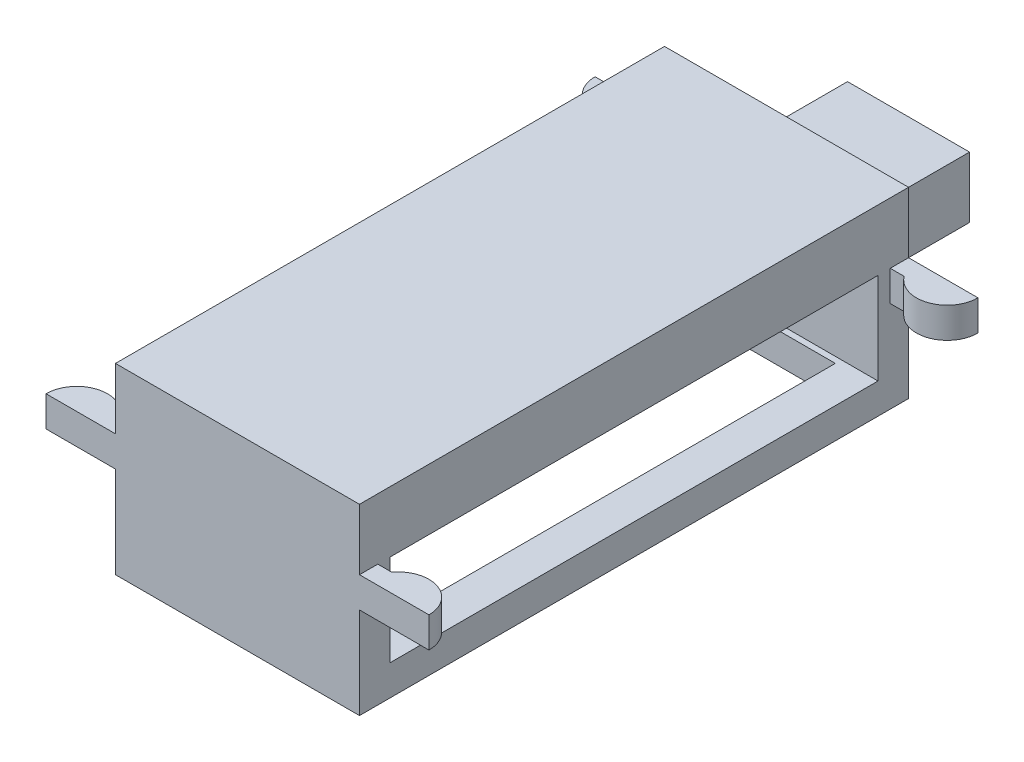
ISO-10303-21;
HEADER;
FILE_DESCRIPTION(('STEP AP214'),'2;1');
FILE_NAME('part.step','',(''),(''),'','','');
FILE_SCHEMA(('AUTOMOTIVE_DESIGN { 1 0 10303 214 1 1 1 1 }'));
ENDSEC;
DATA;
#1=APPLICATION_CONTEXT('core data for automotive mechanical design processes');
#2=APPLICATION_PROTOCOL_DEFINITION('international standard','automotive_design',2000,#1);
#3=PRODUCT_CONTEXT('',#1,'mechanical');
#4=PRODUCT('Part','Part','',(#3));
#5=PRODUCT_RELATED_PRODUCT_CATEGORY('part','',(#4));
#6=PRODUCT_DEFINITION_FORMATION('','',#4);
#7=PRODUCT_DEFINITION_CONTEXT('part definition',#1,'design');
#8=PRODUCT_DEFINITION('design','',#6,#7);
#9=PRODUCT_DEFINITION_SHAPE('','',#8);
#10=(LENGTH_UNIT() NAMED_UNIT(*) SI_UNIT(.MILLI.,.METRE.));
#11=(NAMED_UNIT(*) PLANE_ANGLE_UNIT() SI_UNIT($,.RADIAN.));
#12=(NAMED_UNIT(*) SI_UNIT($,.STERADIAN.) SOLID_ANGLE_UNIT());
#13=UNCERTAINTY_MEASURE_WITH_UNIT(LENGTH_MEASURE(1.E-05),#10,'distance_accuracy_value','');
#14=(GEOMETRIC_REPRESENTATION_CONTEXT(3) GLOBAL_UNCERTAINTY_ASSIGNED_CONTEXT((#13)) GLOBAL_UNIT_ASSIGNED_CONTEXT((#10,
#11,#12)) REPRESENTATION_CONTEXT('',''));
#15=CARTESIAN_POINT('',(0.,0.,0.));
#16=DIRECTION('',(0.,0.,1.));
#17=DIRECTION('',(1.,0.,0.));
#18=AXIS2_PLACEMENT_3D('',#15,#16,#17);
#19=CARTESIAN_POINT('',(0.,0.,-4.5));
#20=DIRECTION('',(0.,0.,-1.));
#21=DIRECTION('',(-1.,0.,0.));
#22=AXIS2_PLACEMENT_3D('',#19,#20,#21);
#23=PLANE('',#22);
#24=DIRECTION('',(0.,-1.,0.));
#25=VECTOR('',#24,1.);
#26=CARTESIAN_POINT('',(2.,1.,-4.5));
#27=LINE('',#26,#25);
#28=CARTESIAN_POINT('',(2.,1.,-4.5));
#29=VERTEX_POINT('',#28);
#30=CARTESIAN_POINT('',(2.,0.,-4.5));
#31=VERTEX_POINT('',#30);
#32=EDGE_CURVE('E441',#29,#31,#27,.T.);
#33=ORIENTED_EDGE('',*,*,#32,.T.);
#34=DIRECTION('',(-1.,0.,0.));
#35=VECTOR('',#34,1.);
#36=CARTESIAN_POINT('',(0.,0.,-4.5));
#37=LINE('',#36,#35);
#38=CARTESIAN_POINT('',(3.13864126573276,0.,-4.50000000000002));
#39=VERTEX_POINT('',#38);
#40=EDGE_CURVE('E336',#39,#31,#37,.T.);
#41=ORIENTED_EDGE('',*,*,#40,.F.);
#42=DIRECTION('',(0.,1.,0.));
#43=VECTOR('',#42,1.);
#44=CARTESIAN_POINT('',(3.13864126573276,-0.5,-4.50000000000002));
#45=LINE('',#44,#43);
#46=CARTESIAN_POINT('',(3.13864126573276,-0.5,-4.50000000000002));
#47=VERTEX_POINT('',#46);
#48=EDGE_CURVE('E347',#47,#39,#45,.T.);
#49=ORIENTED_EDGE('',*,*,#48,.F.);
#50=DIRECTION('',(-1.,0.,0.));
#51=VECTOR('',#50,1.);
#52=CARTESIAN_POINT('',(0.,-0.5,-4.5));
#53=LINE('',#52,#51);
#54=CARTESIAN_POINT('',(2.,-0.5,-4.50000000000001));
#55=VERTEX_POINT('',#54);
#56=EDGE_CURVE('E321',#47,#55,#53,.T.);
#57=ORIENTED_EDGE('',*,*,#56,.T.);
#58=CARTESIAN_POINT('',(2.,-2.,-4.5));
#59=VERTEX_POINT('',#58);
#60=EDGE_CURVE('E445',#55,#59,#27,.T.);
#61=ORIENTED_EDGE('',*,*,#60,.T.);
#62=DIRECTION('',(1.,0.,0.));
#63=VECTOR('',#62,1.);
#64=CARTESIAN_POINT('',(-2.,-2.,-4.5));
#65=LINE('',#64,#63);
#66=CARTESIAN_POINT('',(-2.,-2.,-4.5));
#67=VERTEX_POINT('',#66);
#68=EDGE_CURVE('E404',#67,#59,#65,.T.);
#69=ORIENTED_EDGE('',*,*,#68,.F.);
#70=DIRECTION('',(0.,1.,0.));
#71=VECTOR('',#70,1.);
#72=CARTESIAN_POINT('',(-2.,1.,-4.5));
#73=LINE('',#72,#71);
#74=CARTESIAN_POINT('',(-2.,-0.5,-4.49999999999998));
#75=VERTEX_POINT('',#74);
#76=EDGE_CURVE('E446',#67,#75,#73,.T.);
#77=ORIENTED_EDGE('',*,*,#76,.T.);
#78=CARTESIAN_POINT('',(-3.13864126573276,-0.5,-4.49999999999998));
#79=VERTEX_POINT('',#78);
#80=EDGE_CURVE('E325',#75,#79,#53,.T.);
#81=ORIENTED_EDGE('',*,*,#80,.T.);
#82=DIRECTION('',(0.,1.,0.));
#83=VECTOR('',#82,1.);
#84=CARTESIAN_POINT('',(-3.13864126573276,-0.5,-4.49999999999998));
#85=LINE('',#84,#83);
#86=CARTESIAN_POINT('',(-3.13864126573276,0.,-4.49999999999998));
#87=VERTEX_POINT('',#86);
#88=EDGE_CURVE('E335',#79,#87,#85,.T.);
#89=ORIENTED_EDGE('',*,*,#88,.T.);
#90=CARTESIAN_POINT('',(-2.,0.,-4.49999999999998));
#91=VERTEX_POINT('',#90);
#92=EDGE_CURVE('E320',#91,#87,#37,.T.);
#93=ORIENTED_EDGE('',*,*,#92,.F.);
#94=CARTESIAN_POINT('',(-2.,1.,-4.5));
#95=VERTEX_POINT('',#94);
#96=EDGE_CURVE('E444',#91,#95,#73,.T.);
#97=ORIENTED_EDGE('',*,*,#96,.T.);
#98=DIRECTION('',(1.,0.,0.));
#99=VECTOR('',#98,1.);
#100=CARTESIAN_POINT('',(2.,1.,-4.5));
#101=LINE('',#100,#99);
#102=EDGE_CURVE('E449',#95,#29,#101,.T.);
#103=ORIENTED_EDGE('',*,*,#102,.T.);
#104=EDGE_LOOP('',(#33,#41,#49,#57,#61,#69,#77,#81,#89,#93,#97,#103));
#105=FACE_BOUND('',#104,.T.);
#106=DIRECTION('',(-1.,0.,0.));
#107=VECTOR('',#106,1.);
#108=CARTESIAN_POINT('',(1.,-1.,-4.5));
#109=LINE('',#108,#107);
#110=CARTESIAN_POINT('',(1.,-1.,-4.5));
#111=VERTEX_POINT('',#110);
#112=CARTESIAN_POINT('',(-1.,-1.,-4.5));
#113=VERTEX_POINT('',#112);
#114=EDGE_CURVE('E838',#111,#113,#109,.T.);
#115=ORIENTED_EDGE('',*,*,#114,.F.);
#116=DIRECTION('',(0.,-1.,0.));
#117=VECTOR('',#116,1.);
#118=CARTESIAN_POINT('',(1.,0.,-4.5));
#119=LINE('',#118,#117);
#120=CARTESIAN_POINT('',(1.,0.,-4.5));
#121=VERTEX_POINT('',#120);
#122=EDGE_CURVE('E268',#121,#111,#119,.T.);
#123=ORIENTED_EDGE('',*,*,#122,.F.);
#124=DIRECTION('',(1.,0.,0.));
#125=VECTOR('',#124,1.);
#126=CARTESIAN_POINT('',(1.,0.,-4.5));
#127=LINE('',#126,#125);
#128=CARTESIAN_POINT('',(-1.,0.,-4.5));
#129=VERTEX_POINT('',#128);
#130=EDGE_CURVE('E264',#129,#121,#127,.T.);
#131=ORIENTED_EDGE('',*,*,#130,.F.);
#132=DIRECTION('',(0.,1.,0.));
#133=VECTOR('',#132,1.);
#134=CARTESIAN_POINT('',(-1.,0.,-4.5));
#135=LINE('',#134,#133);
#136=EDGE_CURVE('E835',#113,#129,#135,.T.);
#137=ORIENTED_EDGE('',*,*,#136,.F.);
#138=EDGE_LOOP('',(#115,#123,#131,#137));
#139=FACE_BOUND('',#138,.T.);
#140=ADVANCED_FACE('F37',(#105,#139),#23,.T.);
#141=CARTESIAN_POINT('',(2.,1.,-4.));
#142=DIRECTION('',(-1.,0.,0.));
#143=DIRECTION('',(0.,0.,1.));
#144=AXIS2_PLACEMENT_3D('',#141,#142,#143);
#145=PLANE('',#144);
#146=DIRECTION('',(0.,-1.,0.));
#147=VECTOR('',#146,1.);
#148=CARTESIAN_POINT('',(2.,1.,-4.));
#149=LINE('',#148,#147);
#150=CARTESIAN_POINT('',(2.,0.,-4.));
#151=VERTEX_POINT('',#150);
#152=CARTESIAN_POINT('',(2.,-1.5,-4.));
#153=VERTEX_POINT('',#152);
#154=EDGE_CURVE('E430',#151,#153,#149,.T.);
#155=ORIENTED_EDGE('',*,*,#154,.T.);
#156=DIRECTION('',(0.,0.,1.));
#157=VECTOR('',#156,1.);
#158=CARTESIAN_POINT('',(2.,-1.5,4.5));
#159=LINE('',#158,#157);
#160=CARTESIAN_POINT('',(2.,-1.5,4.));
#161=VERTEX_POINT('',#160);
#162=EDGE_CURVE('E405',#153,#161,#159,.T.);
#163=ORIENTED_EDGE('',*,*,#162,.T.);
#164=DIRECTION('',(0.,-1.,0.));
#165=VECTOR('',#164,1.);
#166=CARTESIAN_POINT('',(2.,1.,4.));
#167=LINE('',#166,#165);
#168=CARTESIAN_POINT('',(2.,0.,4.));
#169=VERTEX_POINT('',#168);
#170=EDGE_CURVE('E414',#169,#161,#167,.T.);
#171=ORIENTED_EDGE('',*,*,#170,.F.);
#172=DIRECTION('',(0.,0.,-1.));
#173=VECTOR('',#172,1.);
#174=CARTESIAN_POINT('',(2.,0.,-4.));
#175=LINE('',#174,#173);
#176=EDGE_CURVE('E452',#169,#151,#175,.T.);
#177=ORIENTED_EDGE('',*,*,#176,.T.);
#178=EDGE_LOOP('',(#155,#163,#171,#177));
#179=FACE_BOUND('',#178,.T.);
#180=DIRECTION('',(0.,0.,-1.));
#181=VECTOR('',#180,1.);
#182=CARTESIAN_POINT('',(2.,-0.5,-4.));
#183=LINE('',#182,#181);
#184=CARTESIAN_POINT('',(2.,-0.5,4.50000000000001));
#185=VERTEX_POINT('',#184);
#186=CARTESIAN_POINT('',(2.,-0.5,4.20000000000001));
#187=VERTEX_POINT('',#186);
#188=EDGE_CURVE('E316',#185,#187,#183,.T.);
#189=ORIENTED_EDGE('',*,*,#188,.F.);
#190=DIRECTION('',(0.,-1.,0.));
#191=VECTOR('',#190,1.);
#192=CARTESIAN_POINT('',(2.,1.,4.5));
#193=LINE('',#192,#191);
#194=CARTESIAN_POINT('',(2.,-2.,4.5));
#195=VERTEX_POINT('',#194);
#196=EDGE_CURVE('E423',#185,#195,#193,.T.);
#197=ORIENTED_EDGE('',*,*,#196,.T.);
#198=DIRECTION('',(0.,0.,1.));
#199=VECTOR('',#198,1.);
#200=CARTESIAN_POINT('',(2.,-2.,4.5));
#201=LINE('',#200,#199);
#202=EDGE_CURVE('E408',#59,#195,#201,.T.);
#203=ORIENTED_EDGE('',*,*,#202,.F.);
#204=ORIENTED_EDGE('',*,*,#60,.F.);
#205=DIRECTION('',(0.,0.,-1.));
#206=VECTOR('',#205,1.);
#207=CARTESIAN_POINT('',(2.,-0.5,-4.));
#208=LINE('',#207,#206);
#209=CARTESIAN_POINT('',(2.,-0.5,-4.20000000000001));
#210=VERTEX_POINT('',#209);
#211=EDGE_CURVE('E364',#210,#55,#208,.T.);
#212=ORIENTED_EDGE('',*,*,#211,.F.);
#213=DIRECTION('',(0.,1.,0.));
#214=VECTOR('',#213,1.);
#215=CARTESIAN_POINT('',(2.,1.,-4.20000000000001));
#216=LINE('',#215,#214);
#217=CARTESIAN_POINT('',(2.,0.,-4.20000000000001));
#218=VERTEX_POINT('',#217);
#219=EDGE_CURVE('E366',#210,#218,#216,.T.);
#220=ORIENTED_EDGE('',*,*,#219,.T.);
#221=DIRECTION('',(0.,0.,-1.));
#222=VECTOR('',#221,1.);
#223=CARTESIAN_POINT('',(2.,0.,-4.));
#224=LINE('',#223,#222);
#225=EDGE_CURVE('E359',#218,#31,#224,.T.);
#226=ORIENTED_EDGE('',*,*,#225,.T.);
#227=ORIENTED_EDGE('',*,*,#32,.F.);
#228=DIRECTION('',(0.,0.,-1.));
#229=VECTOR('',#228,1.);
#230=CARTESIAN_POINT('',(2.,1.,-4.));
#231=LINE('',#230,#229);
#232=CARTESIAN_POINT('',(2.,1.,4.5));
#233=VERTEX_POINT('',#232);
#234=EDGE_CURVE('E464',#233,#29,#231,.T.);
#235=ORIENTED_EDGE('',*,*,#234,.F.);
#236=CARTESIAN_POINT('',(2.,0.,4.50000000000001));
#237=VERTEX_POINT('',#236);
#238=EDGE_CURVE('E419',#233,#237,#193,.T.);
#239=ORIENTED_EDGE('',*,*,#238,.T.);
#240=DIRECTION('',(0.,0.,-1.));
#241=VECTOR('',#240,1.);
#242=CARTESIAN_POINT('',(2.,0.,-4.));
#243=LINE('',#242,#241);
#244=CARTESIAN_POINT('',(2.,0.,4.2));
#245=VERTEX_POINT('',#244);
#246=EDGE_CURVE('E311',#237,#245,#243,.T.);
#247=ORIENTED_EDGE('',*,*,#246,.T.);
#248=DIRECTION('',(0.,1.,0.));
#249=VECTOR('',#248,1.);
#250=CARTESIAN_POINT('',(2.,1.,4.20000000000001));
#251=LINE('',#250,#249);
#252=EDGE_CURVE('E318',#187,#245,#251,.T.);
#253=ORIENTED_EDGE('',*,*,#252,.F.);
#254=EDGE_LOOP('',(#189,#197,#203,#204,#212,#220,#226,#227,#235,#239,#247,#253));
#255=FACE_BOUND('',#254,.T.);
#256=ADVANCED_FACE('F39',(#179,#255),#145,.F.);
#257=CARTESIAN_POINT('',(-2.,1.,-4.));
#258=DIRECTION('',(1.,0.,0.));
#259=DIRECTION('',(0.,0.,-1.));
#260=AXIS2_PLACEMENT_3D('',#257,#258,#259);
#261=PLANE('',#260);
#262=DIRECTION('',(0.,0.,-1.));
#263=VECTOR('',#262,1.);
#264=CARTESIAN_POINT('',(-2.,-1.5,4.5));
#265=LINE('',#264,#263);
#266=CARTESIAN_POINT('',(-2.,-1.5,4.));
#267=VERTEX_POINT('',#266);
#268=CARTESIAN_POINT('',(-2.,-1.5,-4.));
#269=VERTEX_POINT('',#268);
#270=EDGE_CURVE('E400',#267,#269,#265,.T.);
#271=ORIENTED_EDGE('',*,*,#270,.T.);
#272=DIRECTION('',(0.,1.,0.));
#273=VECTOR('',#272,1.);
#274=CARTESIAN_POINT('',(-2.,1.,-4.));
#275=LINE('',#274,#273);
#276=CARTESIAN_POINT('',(-2.,0.,-4.));
#277=VERTEX_POINT('',#276);
#278=EDGE_CURVE('E461',#269,#277,#275,.T.);
#279=ORIENTED_EDGE('',*,*,#278,.T.);
#280=DIRECTION('',(0.,0.,1.));
#281=VECTOR('',#280,1.);
#282=CARTESIAN_POINT('',(-2.,0.,-4.));
#283=LINE('',#282,#281);
#284=CARTESIAN_POINT('',(-2.,0.,4.));
#285=VERTEX_POINT('',#284);
#286=EDGE_CURVE('E479',#277,#285,#283,.T.);
#287=ORIENTED_EDGE('',*,*,#286,.T.);
#288=DIRECTION('',(0.,1.,0.));
#289=VECTOR('',#288,1.);
#290=CARTESIAN_POINT('',(-2.,1.,4.));
#291=LINE('',#290,#289);
#292=EDGE_CURVE('E437',#267,#285,#291,.T.);
#293=ORIENTED_EDGE('',*,*,#292,.F.);
#294=EDGE_LOOP('',(#271,#279,#287,#293));
#295=FACE_BOUND('',#294,.T.);
#296=DIRECTION('',(0.,0.,1.));
#297=VECTOR('',#296,1.);
#298=CARTESIAN_POINT('',(-2.,-0.5,-4.));
#299=LINE('',#298,#297);
#300=CARTESIAN_POINT('',(-2.,-0.5,4.19999999999999));
#301=VERTEX_POINT('',#300);
#302=CARTESIAN_POINT('',(-2.,-0.5,4.49999999999998));
#303=VERTEX_POINT('',#302);
#304=EDGE_CURVE('E314',#301,#303,#299,.T.);
#305=ORIENTED_EDGE('',*,*,#304,.F.);
#306=DIRECTION('',(0.,-1.,0.));
#307=VECTOR('',#306,1.);
#308=CARTESIAN_POINT('',(-2.,1.,4.19999999999999));
#309=LINE('',#308,#307);
#310=CARTESIAN_POINT('',(-2.,0.,4.19999999999999));
#311=VERTEX_POINT('',#310);
#312=EDGE_CURVE('E11',#311,#301,#309,.T.);
#313=ORIENTED_EDGE('',*,*,#312,.F.);
#314=DIRECTION('',(0.,0.,1.));
#315=VECTOR('',#314,1.);
#316=CARTESIAN_POINT('',(-2.,0.,-4.));
#317=LINE('',#316,#315);
#318=CARTESIAN_POINT('',(-2.,0.,4.5));
#319=VERTEX_POINT('',#318);
#320=EDGE_CURVE('E300',#311,#319,#317,.T.);
#321=ORIENTED_EDGE('',*,*,#320,.T.);
#322=DIRECTION('',(0.,1.,0.));
#323=VECTOR('',#322,1.);
#324=CARTESIAN_POINT('',(-2.,1.,4.5));
#325=LINE('',#324,#323);
#326=CARTESIAN_POINT('',(-2.,1.,4.5));
#327=VERTEX_POINT('',#326);
#328=EDGE_CURVE('E426',#319,#327,#325,.T.);
#329=ORIENTED_EDGE('',*,*,#328,.T.);
#330=DIRECTION('',(0.,0.,1.));
#331=VECTOR('',#330,1.);
#332=CARTESIAN_POINT('',(-2.,1.,-4.));
#333=LINE('',#332,#331);
#334=EDGE_CURVE('E466',#95,#327,#333,.T.);
#335=ORIENTED_EDGE('',*,*,#334,.F.);
#336=ORIENTED_EDGE('',*,*,#96,.F.);
#337=DIRECTION('',(0.,0.,1.));
#338=VECTOR('',#337,1.);
#339=CARTESIAN_POINT('',(-2.,0.,-4.));
#340=LINE('',#339,#338);
#341=CARTESIAN_POINT('',(-2.,0.,-4.2));
#342=VERTEX_POINT('',#341);
#343=EDGE_CURVE('E349',#91,#342,#340,.T.);
#344=ORIENTED_EDGE('',*,*,#343,.T.);
#345=DIRECTION('',(0.,-1.,0.));
#346=VECTOR('',#345,1.);
#347=CARTESIAN_POINT('',(-2.,1.,-4.19999999999999));
#348=LINE('',#347,#346);
#349=CARTESIAN_POINT('',(-2.,-0.5,-4.19999999999999));
#350=VERTEX_POINT('',#349);
#351=EDGE_CURVE('E45',#342,#350,#348,.T.);
#352=ORIENTED_EDGE('',*,*,#351,.T.);
#353=DIRECTION('',(0.,0.,1.));
#354=VECTOR('',#353,1.);
#355=CARTESIAN_POINT('',(-2.,-0.5,-4.));
#356=LINE('',#355,#354);
#357=EDGE_CURVE('E362',#75,#350,#356,.T.);
#358=ORIENTED_EDGE('',*,*,#357,.F.);
#359=ORIENTED_EDGE('',*,*,#76,.F.);
#360=DIRECTION('',(0.,0.,-1.));
#361=VECTOR('',#360,1.);
#362=CARTESIAN_POINT('',(-2.,-2.,4.5));
#363=LINE('',#362,#361);
#364=CARTESIAN_POINT('',(-2.,-2.,4.5));
#365=VERTEX_POINT('',#364);
#366=EDGE_CURVE('E401',#365,#67,#363,.T.);
#367=ORIENTED_EDGE('',*,*,#366,.F.);
#368=EDGE_CURVE('E427',#365,#303,#325,.T.);
#369=ORIENTED_EDGE('',*,*,#368,.T.);
#370=EDGE_LOOP('',(#305,#313,#321,#329,#335,#336,#344,#352,#358,#359,#367,#369));
#371=FACE_BOUND('',#370,.T.);
#372=ADVANCED_FACE('F491',(#295,#371),#261,.F.);
#373=CARTESIAN_POINT('',(0.,1.,0.));
#374=DIRECTION('',(0.,1.,0.));
#375=DIRECTION('',(0.,0.,1.));
#376=AXIS2_PLACEMENT_3D('',#373,#374,#375);
#377=PLANE('',#376);
#378=ORIENTED_EDGE('',*,*,#234,.T.);
#379=ORIENTED_EDGE('',*,*,#102,.F.);
#380=ORIENTED_EDGE('',*,*,#334,.T.);
#381=DIRECTION('',(1.,0.,0.));
#382=VECTOR('',#381,1.);
#383=CARTESIAN_POINT('',(2.,1.,4.5));
#384=LINE('',#383,#382);
#385=EDGE_CURVE('E422',#327,#233,#384,.T.);
#386=ORIENTED_EDGE('',*,*,#385,.T.);
#387=EDGE_LOOP('',(#378,#379,#380,#386));
#388=FACE_BOUND('',#387,.T.);
#389=ADVANCED_FACE('F537',(#388),#377,.T.);
#390=CARTESIAN_POINT('',(0.,0.,0.));
#391=DIRECTION('',(0.,1.,0.));
#392=DIRECTION('',(0.,0.,1.));
#393=AXIS2_PLACEMENT_3D('',#390,#391,#392);
#394=PLANE('',#393);
#395=ORIENTED_EDGE('',*,*,#176,.F.);
#396=DIRECTION('',(1.,0.,0.));
#397=VECTOR('',#396,1.);
#398=CARTESIAN_POINT('',(-2.,0.,4.));
#399=LINE('',#398,#397);
#400=EDGE_CURVE('E467',#285,#169,#399,.T.);
#401=ORIENTED_EDGE('',*,*,#400,.F.);
#402=ORIENTED_EDGE('',*,*,#286,.F.);
#403=DIRECTION('',(-1.,0.,0.));
#404=VECTOR('',#403,1.);
#405=CARTESIAN_POINT('',(-2.,0.,-4.));
#406=LINE('',#405,#404);
#407=EDGE_CURVE('E475',#151,#277,#406,.T.);
#408=ORIENTED_EDGE('',*,*,#407,.F.);
#409=EDGE_LOOP('',(#395,#401,#402,#408));
#410=FACE_BOUND('',#409,.T.);
#411=ADVANCED_FACE('F574',(#410),#394,.F.);
#412=CARTESIAN_POINT('',(0.,0.,-4.));
#413=DIRECTION('',(0.,0.,-1.));
#414=DIRECTION('',(-1.,0.,0.));
#415=AXIS2_PLACEMENT_3D('',#412,#413,#414);
#416=PLANE('',#415);
#417=ORIENTED_EDGE('',*,*,#154,.F.);
#418=ORIENTED_EDGE('',*,*,#407,.T.);
#419=ORIENTED_EDGE('',*,*,#278,.F.);
#420=DIRECTION('',(-1.,0.,0.));
#421=VECTOR('',#420,1.);
#422=CARTESIAN_POINT('',(2.,-1.5,-4.));
#423=LINE('',#422,#421);
#424=EDGE_CURVE('E455',#153,#269,#423,.T.);
#425=ORIENTED_EDGE('',*,*,#424,.F.);
#426=EDGE_LOOP('',(#417,#418,#419,#425));
#427=FACE_BOUND('',#426,.T.);
#428=ADVANCED_FACE('F572',(#427),#416,.F.);
#429=CARTESIAN_POINT('',(0.,0.,4.));
#430=DIRECTION('',(0.,0.,1.));
#431=DIRECTION('',(-1.,0.,0.));
#432=AXIS2_PLACEMENT_3D('',#429,#430,#431);
#433=PLANE('',#432);
#434=ORIENTED_EDGE('',*,*,#292,.T.);
#435=ORIENTED_EDGE('',*,*,#400,.T.);
#436=ORIENTED_EDGE('',*,*,#170,.T.);
#437=DIRECTION('',(-1.,0.,0.));
#438=VECTOR('',#437,1.);
#439=CARTESIAN_POINT('',(2.,-1.5,4.));
#440=LINE('',#439,#438);
#441=EDGE_CURVE('E438',#161,#267,#440,.T.);
#442=ORIENTED_EDGE('',*,*,#441,.T.);
#443=EDGE_LOOP('',(#434,#435,#436,#442));
#444=FACE_BOUND('',#443,.T.);
#445=ADVANCED_FACE('F563',(#444),#433,.F.);
#446=CARTESIAN_POINT('',(0.,0.,4.5));
#447=DIRECTION('',(0.,0.,1.));
#448=DIRECTION('',(-1.,0.,0.));
#449=AXIS2_PLACEMENT_3D('',#446,#447,#448);
#450=PLANE('',#449);
#451=ORIENTED_EDGE('',*,*,#328,.F.);
#452=DIRECTION('',(1.,0.,0.));
#453=VECTOR('',#452,1.);
#454=CARTESIAN_POINT('',(0.,0.,4.5));
#455=LINE('',#454,#453);
#456=CARTESIAN_POINT('',(-3.13864126573276,0.,4.49999999999998));
#457=VERTEX_POINT('',#456);
#458=EDGE_CURVE('E272',#457,#319,#455,.T.);
#459=ORIENTED_EDGE('',*,*,#458,.F.);
#460=DIRECTION('',(0.,1.,0.));
#461=VECTOR('',#460,1.);
#462=CARTESIAN_POINT('',(-3.13864126573276,-0.5,4.49999999999998));
#463=LINE('',#462,#461);
#464=CARTESIAN_POINT('',(-3.13864126573276,-0.5,4.49999999999998));
#465=VERTEX_POINT('',#464);
#466=EDGE_CURVE('E298',#465,#457,#463,.T.);
#467=ORIENTED_EDGE('',*,*,#466,.F.);
#468=DIRECTION('',(1.,0.,0.));
#469=VECTOR('',#468,1.);
#470=CARTESIAN_POINT('',(0.,-0.5,4.5));
#471=LINE('',#470,#469);
#472=EDGE_CURVE('E277',#465,#303,#471,.T.);
#473=ORIENTED_EDGE('',*,*,#472,.T.);
#474=ORIENTED_EDGE('',*,*,#368,.F.);
#475=DIRECTION('',(-1.,0.,0.));
#476=VECTOR('',#475,1.);
#477=CARTESIAN_POINT('',(-2.,-2.,4.5));
#478=LINE('',#477,#476);
#479=EDGE_CURVE('E411',#195,#365,#478,.T.);
#480=ORIENTED_EDGE('',*,*,#479,.F.);
#481=ORIENTED_EDGE('',*,*,#196,.F.);
#482=CARTESIAN_POINT('',(3.13864126573276,-0.5,4.50000000000002));
#483=VERTEX_POINT('',#482);
#484=EDGE_CURVE('E281',#185,#483,#471,.T.);
#485=ORIENTED_EDGE('',*,*,#484,.T.);
#486=DIRECTION('',(0.,1.,0.));
#487=VECTOR('',#486,1.);
#488=CARTESIAN_POINT('',(3.13864126573276,-0.5,4.50000000000002));
#489=LINE('',#488,#487);
#490=CARTESIAN_POINT('',(3.13864126573276,0.,4.50000000000002));
#491=VERTEX_POINT('',#490);
#492=EDGE_CURVE('E289',#483,#491,#489,.T.);
#493=ORIENTED_EDGE('',*,*,#492,.T.);
#494=EDGE_CURVE('E270',#237,#491,#455,.T.);
#495=ORIENTED_EDGE('',*,*,#494,.F.);
#496=ORIENTED_EDGE('',*,*,#238,.F.);
#497=ORIENTED_EDGE('',*,*,#385,.F.);
#498=EDGE_LOOP('',(#451,#459,#467,#473,#474,#480,#481,#485,#493,#495,#496,#497));
#499=FACE_BOUND('',#498,.T.);
#500=ADVANCED_FACE('F517',(#499),#450,.T.);
#501=CARTESIAN_POINT('',(0.,-1.5,0.));
#502=DIRECTION('',(0.,-1.,0.));
#503=DIRECTION('',(0.,0.,-1.));
#504=AXIS2_PLACEMENT_3D('',#501,#502,#503);
#505=PLANE('',#504);
#506=DIRECTION('',(0.,0.,-1.));
#507=VECTOR('',#506,1.);
#508=CARTESIAN_POINT('',(-1.4,-1.5,3.9));
#509=LINE('',#508,#507);
#510=CARTESIAN_POINT('',(-1.4,-1.5,3.9));
#511=VERTEX_POINT('',#510);
#512=CARTESIAN_POINT('',(-1.4,-1.5,-3.9));
#513=VERTEX_POINT('',#512);
#514=EDGE_CURVE('E369',#511,#513,#509,.T.);
#515=ORIENTED_EDGE('',*,*,#514,.T.);
#516=DIRECTION('',(1.,0.,0.));
#517=VECTOR('',#516,1.);
#518=CARTESIAN_POINT('',(-1.4,-1.5,-3.9));
#519=LINE('',#518,#517);
#520=CARTESIAN_POINT('',(1.4,-1.5,-3.9));
#521=VERTEX_POINT('',#520);
#522=EDGE_CURVE('E383',#513,#521,#519,.T.);
#523=ORIENTED_EDGE('',*,*,#522,.T.);
#524=DIRECTION('',(0.,0.,1.));
#525=VECTOR('',#524,1.);
#526=CARTESIAN_POINT('',(1.4,-1.5,3.9));
#527=LINE('',#526,#525);
#528=CARTESIAN_POINT('',(1.4,-1.5,3.9));
#529=VERTEX_POINT('',#528);
#530=EDGE_CURVE('E386',#521,#529,#527,.T.);
#531=ORIENTED_EDGE('',*,*,#530,.T.);
#532=DIRECTION('',(-1.,0.,0.));
#533=VECTOR('',#532,1.);
#534=CARTESIAN_POINT('',(-1.4,-1.5,3.9));
#535=LINE('',#534,#533);
#536=EDGE_CURVE('E373',#529,#511,#535,.T.);
#537=ORIENTED_EDGE('',*,*,#536,.T.);
#538=EDGE_LOOP('',(#515,#523,#531,#537));
#539=FACE_BOUND('',#538,.T.);
#540=ORIENTED_EDGE('',*,*,#162,.F.);
#541=ORIENTED_EDGE('',*,*,#424,.T.);
#542=ORIENTED_EDGE('',*,*,#270,.F.);
#543=ORIENTED_EDGE('',*,*,#441,.F.);
#544=EDGE_LOOP('',(#540,#541,#542,#543));
#545=FACE_BOUND('',#544,.T.);
#546=ADVANCED_FACE('F566',(#539,#545),#505,.F.);
#547=CARTESIAN_POINT('',(0.,-2.,0.));
#548=DIRECTION('',(0.,-1.,0.));
#549=DIRECTION('',(0.,0.,-1.));
#550=AXIS2_PLACEMENT_3D('',#547,#548,#549);
#551=PLANE('',#550);
#552=ORIENTED_EDGE('',*,*,#366,.T.);
#553=ORIENTED_EDGE('',*,*,#68,.T.);
#554=ORIENTED_EDGE('',*,*,#202,.T.);
#555=ORIENTED_EDGE('',*,*,#479,.T.);
#556=EDGE_LOOP('',(#552,#553,#554,#555));
#557=FACE_BOUND('',#556,.T.);
#558=DIRECTION('',(1.,0.,0.));
#559=VECTOR('',#558,1.);
#560=CARTESIAN_POINT('',(-1.4,-2.,-3.9));
#561=LINE('',#560,#559);
#562=CARTESIAN_POINT('',(-1.4,-2.,-3.9));
#563=VERTEX_POINT('',#562);
#564=CARTESIAN_POINT('',(1.4,-2.,-3.9));
#565=VERTEX_POINT('',#564);
#566=EDGE_CURVE('E372',#563,#565,#561,.T.);
#567=ORIENTED_EDGE('',*,*,#566,.F.);
#568=DIRECTION('',(0.,0.,-1.));
#569=VECTOR('',#568,1.);
#570=CARTESIAN_POINT('',(-1.4,-2.,3.9));
#571=LINE('',#570,#569);
#572=CARTESIAN_POINT('',(-1.4,-2.,3.9));
#573=VERTEX_POINT('',#572);
#574=EDGE_CURVE('E370',#573,#563,#571,.T.);
#575=ORIENTED_EDGE('',*,*,#574,.F.);
#576=DIRECTION('',(-1.,0.,0.));
#577=VECTOR('',#576,1.);
#578=CARTESIAN_POINT('',(-1.4,-2.,3.9));
#579=LINE('',#578,#577);
#580=CARTESIAN_POINT('',(1.4,-2.,3.9));
#581=VERTEX_POINT('',#580);
#582=EDGE_CURVE('E378',#581,#573,#579,.T.);
#583=ORIENTED_EDGE('',*,*,#582,.F.);
#584=DIRECTION('',(0.,0.,1.));
#585=VECTOR('',#584,1.);
#586=CARTESIAN_POINT('',(1.4,-2.,3.9));
#587=LINE('',#586,#585);
#588=EDGE_CURVE('E375',#565,#581,#587,.T.);
#589=ORIENTED_EDGE('',*,*,#588,.F.);
#590=EDGE_LOOP('',(#567,#575,#583,#589));
#591=FACE_BOUND('',#590,.T.);
#592=ADVANCED_FACE('F510',(#557,#591),#551,.T.);
#593=CARTESIAN_POINT('',(-1.4,-2.,3.9));
#594=DIRECTION('',(1.,0.,0.));
#595=DIRECTION('',(0.,0.,-1.));
#596=AXIS2_PLACEMENT_3D('',#593,#594,#595);
#597=PLANE('',#596);
#598=ORIENTED_EDGE('',*,*,#514,.F.);
#599=DIRECTION('',(0.,1.,0.));
#600=VECTOR('',#599,1.);
#601=CARTESIAN_POINT('',(-1.4,-2.,3.9));
#602=LINE('',#601,#600);
#603=EDGE_CURVE('E380',#573,#511,#602,.T.);
#604=ORIENTED_EDGE('',*,*,#603,.F.);
#605=ORIENTED_EDGE('',*,*,#574,.T.);
#606=DIRECTION('',(0.,1.,0.));
#607=VECTOR('',#606,1.);
#608=CARTESIAN_POINT('',(-1.4,-2.,-3.9));
#609=LINE('',#608,#607);
#610=EDGE_CURVE('E397',#563,#513,#609,.T.);
#611=ORIENTED_EDGE('',*,*,#610,.T.);
#612=EDGE_LOOP('',(#598,#604,#605,#611));
#613=FACE_BOUND('',#612,.T.);
#614=ADVANCED_FACE('F622',(#613),#597,.T.);
#615=CARTESIAN_POINT('',(-1.4,-2.,-3.9));
#616=DIRECTION('',(0.,0.,1.));
#617=DIRECTION('',(1.,0.,0.));
#618=AXIS2_PLACEMENT_3D('',#615,#616,#617);
#619=PLANE('',#618);
#620=ORIENTED_EDGE('',*,*,#522,.F.);
#621=ORIENTED_EDGE('',*,*,#610,.F.);
#622=ORIENTED_EDGE('',*,*,#566,.T.);
#623=DIRECTION('',(0.,1.,0.));
#624=VECTOR('',#623,1.);
#625=CARTESIAN_POINT('',(1.4,-2.,-3.9));
#626=LINE('',#625,#624);
#627=EDGE_CURVE('E395',#565,#521,#626,.T.);
#628=ORIENTED_EDGE('',*,*,#627,.T.);
#629=EDGE_LOOP('',(#620,#621,#622,#628));
#630=FACE_BOUND('',#629,.T.);
#631=ADVANCED_FACE('F629',(#630),#619,.T.);
#632=CARTESIAN_POINT('',(1.4,-2.,3.9));
#633=DIRECTION('',(-1.,0.,0.));
#634=DIRECTION('',(0.,0.,1.));
#635=AXIS2_PLACEMENT_3D('',#632,#633,#634);
#636=PLANE('',#635);
#637=ORIENTED_EDGE('',*,*,#530,.F.);
#638=ORIENTED_EDGE('',*,*,#627,.F.);
#639=ORIENTED_EDGE('',*,*,#588,.T.);
#640=DIRECTION('',(0.,1.,0.));
#641=VECTOR('',#640,1.);
#642=CARTESIAN_POINT('',(1.4,-2.,3.9));
#643=LINE('',#642,#641);
#644=EDGE_CURVE('E393',#581,#529,#643,.T.);
#645=ORIENTED_EDGE('',*,*,#644,.T.);
#646=EDGE_LOOP('',(#637,#638,#639,#645));
#647=FACE_BOUND('',#646,.T.);
#648=ADVANCED_FACE('F637',(#647),#636,.T.);
#649=CARTESIAN_POINT('',(-1.4,-2.,3.9));
#650=DIRECTION('',(0.,0.,-1.));
#651=DIRECTION('',(-1.,0.,0.));
#652=AXIS2_PLACEMENT_3D('',#649,#650,#651);
#653=PLANE('',#652);
#654=ORIENTED_EDGE('',*,*,#536,.F.);
#655=ORIENTED_EDGE('',*,*,#644,.F.);
#656=ORIENTED_EDGE('',*,*,#582,.T.);
#657=ORIENTED_EDGE('',*,*,#603,.T.);
#658=EDGE_LOOP('',(#654,#655,#656,#657));
#659=FACE_BOUND('',#658,.T.);
#660=ADVANCED_FACE('F645',(#659),#653,.T.);
#661=CARTESIAN_POINT('',(-2.63386895184272,-0.5,-4.49999999999998));
#662=DIRECTION('',(0.,1.,0.));
#663=DIRECTION('',(0.,0.,1.));
#664=AXIS2_PLACEMENT_3D('',#661,#662,#663);
#665=CYLINDRICAL_SURFACE('',#664,0.504772313890046);
#666=CARTESIAN_POINT('',(-2.63386895184272,0.,-4.49999999999998));
#667=DIRECTION('',(0.,1.,0.));
#668=DIRECTION('',(0.,0.,1.));
#669=AXIS2_PLACEMENT_3D('',#666,#667,#668);
#670=CIRCLE('',#669,0.504772313890046);
#671=CARTESIAN_POINT('',(-2.22791933813442,0.,-4.19999999999998));
#672=VERTEX_POINT('',#671);
#673=EDGE_CURVE('E338',#87,#672,#670,.T.);
#674=ORIENTED_EDGE('',*,*,#673,.F.);
#675=ORIENTED_EDGE('',*,*,#88,.F.);
#676=CARTESIAN_POINT('',(-2.63386895184272,-0.5,-4.49999999999998));
#677=DIRECTION('',(0.,1.,0.));
#678=DIRECTION('',(0.,0.,1.));
#679=AXIS2_PLACEMENT_3D('',#676,#677,#678);
#680=CIRCLE('',#679,0.504772313890046);
#681=CARTESIAN_POINT('',(-2.22791933813442,-0.5,-4.19999999999998));
#682=VERTEX_POINT('',#681);
#683=EDGE_CURVE('E324',#79,#682,#680,.T.);
#684=ORIENTED_EDGE('',*,*,#683,.T.);
#685=DIRECTION('',(0.,1.,0.));
#686=VECTOR('',#685,1.);
#687=CARTESIAN_POINT('',(-2.22791933813442,-0.5,-4.19999999999998));
#688=LINE('',#687,#686);
#689=EDGE_CURVE('E353',#682,#672,#688,.T.);
#690=ORIENTED_EDGE('',*,*,#689,.T.);
#691=EDGE_LOOP('',(#674,#675,#684,#690));
#692=FACE_BOUND('',#691,.T.);
#693=ADVANCED_FACE('F503',(#692),#665,.T.);
#694=CARTESIAN_POINT('',(0.,-0.5,0.));
#695=DIRECTION('',(0.,1.,0.));
#696=DIRECTION('',(0.,0.,1.));
#697=AXIS2_PLACEMENT_3D('',#694,#695,#696);
#698=PLANE('',#697);
#699=ORIENTED_EDGE('',*,*,#80,.F.);
#700=ORIENTED_EDGE('',*,*,#357,.T.);
#701=DIRECTION('',(1.,0.,0.));
#702=VECTOR('',#701,1.);
#703=CARTESIAN_POINT('',(0.,-0.5,-4.2));
#704=LINE('',#703,#702);
#705=EDGE_CURVE('E329',#682,#350,#704,.T.);
#706=ORIENTED_EDGE('',*,*,#705,.F.);
#707=ORIENTED_EDGE('',*,*,#683,.F.);
#708=EDGE_LOOP('',(#699,#700,#706,#707));
#709=FACE_BOUND('',#708,.T.);
#710=ADVANCED_FACE('F499',(#709),#698,.F.);
#711=CARTESIAN_POINT('',(0.,0.,0.));
#712=DIRECTION('',(0.,1.,0.));
#713=DIRECTION('',(0.,0.,1.));
#714=AXIS2_PLACEMENT_3D('',#711,#712,#713);
#715=PLANE('',#714);
#716=ORIENTED_EDGE('',*,*,#343,.F.);
#717=ORIENTED_EDGE('',*,*,#92,.T.);
#718=ORIENTED_EDGE('',*,*,#673,.T.);
#719=DIRECTION('',(1.,0.,0.));
#720=VECTOR('',#719,1.);
#721=CARTESIAN_POINT('',(0.,0.,-4.2));
#722=LINE('',#721,#720);
#723=EDGE_CURVE('E342',#672,#342,#722,.T.);
#724=ORIENTED_EDGE('',*,*,#723,.T.);
#725=EDGE_LOOP('',(#716,#717,#718,#724));
#726=FACE_BOUND('',#725,.T.);
#727=ADVANCED_FACE('F684',(#726),#715,.T.);
#728=CARTESIAN_POINT('',(0.,-0.5,-4.2));
#729=DIRECTION('',(0.,0.,1.));
#730=DIRECTION('',(1.,0.,0.));
#731=AXIS2_PLACEMENT_3D('',#728,#729,#730);
#732=PLANE('',#731);
#733=ORIENTED_EDGE('',*,*,#351,.F.);
#734=ORIENTED_EDGE('',*,*,#723,.F.);
#735=ORIENTED_EDGE('',*,*,#689,.F.);
#736=ORIENTED_EDGE('',*,*,#705,.T.);
#737=EDGE_LOOP('',(#733,#734,#735,#736));
#738=FACE_BOUND('',#737,.T.);
#739=ADVANCED_FACE('F495',(#738),#732,.T.);
#740=ORIENTED_EDGE('',*,*,#219,.F.);
#741=CARTESIAN_POINT('',(2.22791933813442,-0.5,-4.20000000000001));
#742=VERTEX_POINT('',#741);
#743=EDGE_CURVE('E328',#210,#742,#704,.T.);
#744=ORIENTED_EDGE('',*,*,#743,.T.);
#745=DIRECTION('',(0.,1.,0.));
#746=VECTOR('',#745,1.);
#747=CARTESIAN_POINT('',(2.22791933813442,-0.5,-4.20000000000001));
#748=LINE('',#747,#746);
#749=CARTESIAN_POINT('',(2.22791933813442,0.,-4.20000000000001));
#750=VERTEX_POINT('',#749);
#751=EDGE_CURVE('E350',#742,#750,#748,.T.);
#752=ORIENTED_EDGE('',*,*,#751,.T.);
#753=EDGE_CURVE('E341',#218,#750,#722,.T.);
#754=ORIENTED_EDGE('',*,*,#753,.F.);
#755=EDGE_LOOP('',(#740,#744,#752,#754));
#756=FACE_BOUND('',#755,.T.);
#757=ADVANCED_FACE('F548',(#756),#732,.T.);
#758=ORIENTED_EDGE('',*,*,#743,.F.);
#759=ORIENTED_EDGE('',*,*,#211,.T.);
#760=ORIENTED_EDGE('',*,*,#56,.F.);
#761=CARTESIAN_POINT('',(2.63386895184271,-0.5,-4.50000000000002));
#762=DIRECTION('',(0.,1.,0.));
#763=DIRECTION('',(0.,0.,1.));
#764=AXIS2_PLACEMENT_3D('',#761,#762,#763);
#765=CIRCLE('',#764,0.504772313890046);
#766=EDGE_CURVE('E332',#47,#742,#765,.F.);
#767=ORIENTED_EDGE('',*,*,#766,.T.);
#768=EDGE_LOOP('',(#758,#759,#760,#767));
#769=FACE_BOUND('',#768,.T.);
#770=ADVANCED_FACE('F557',(#769),#698,.F.);
#771=ORIENTED_EDGE('',*,*,#225,.F.);
#772=ORIENTED_EDGE('',*,*,#753,.T.);
#773=CARTESIAN_POINT('',(2.63386895184271,0.,-4.50000000000002));
#774=DIRECTION('',(0.,1.,0.));
#775=DIRECTION('',(0.,0.,1.));
#776=AXIS2_PLACEMENT_3D('',#773,#774,#775);
#777=CIRCLE('',#776,0.504772313890046);
#778=EDGE_CURVE('E344',#39,#750,#777,.F.);
#779=ORIENTED_EDGE('',*,*,#778,.F.);
#780=ORIENTED_EDGE('',*,*,#40,.T.);
#781=EDGE_LOOP('',(#771,#772,#779,#780));
#782=FACE_BOUND('',#781,.T.);
#783=ADVANCED_FACE('F545',(#782),#715,.T.);
#784=CARTESIAN_POINT('',(2.63386895184271,-0.5,-4.50000000000002));
#785=DIRECTION('',(0.,1.,0.));
#786=DIRECTION('',(0.,0.,1.));
#787=AXIS2_PLACEMENT_3D('',#784,#785,#786);
#788=CYLINDRICAL_SURFACE('',#787,0.504772313890046);
#789=ORIENTED_EDGE('',*,*,#778,.T.);
#790=ORIENTED_EDGE('',*,*,#751,.F.);
#791=ORIENTED_EDGE('',*,*,#766,.F.);
#792=ORIENTED_EDGE('',*,*,#48,.T.);
#793=EDGE_LOOP('',(#789,#790,#791,#792));
#794=FACE_BOUND('',#793,.T.);
#795=ADVANCED_FACE('F553',(#794),#788,.T.);
#796=CARTESIAN_POINT('',(-2.63386895184272,-0.5,4.49999999999998));
#797=DIRECTION('',(0.,1.,0.));
#798=DIRECTION('',(0.,0.,1.));
#799=AXIS2_PLACEMENT_3D('',#796,#797,#798);
#800=CYLINDRICAL_SURFACE('',#799,0.504772313890046);
#801=CARTESIAN_POINT('',(-2.63386895184272,0.,4.49999999999998));
#802=DIRECTION('',(0.,1.,0.));
#803=DIRECTION('',(0.,0.,1.));
#804=AXIS2_PLACEMENT_3D('',#801,#802,#803);
#805=CIRCLE('',#804,0.504772313890046);
#806=CARTESIAN_POINT('',(-2.22791933813442,0.,4.19999999999998));
#807=VERTEX_POINT('',#806);
#808=EDGE_CURVE('E296',#457,#807,#805,.F.);
#809=ORIENTED_EDGE('',*,*,#808,.T.);
#810=DIRECTION('',(0.,1.,0.));
#811=VECTOR('',#810,1.);
#812=CARTESIAN_POINT('',(-2.22791933813442,-0.5,4.19999999999998));
#813=LINE('',#812,#811);
#814=CARTESIAN_POINT('',(-2.22791933813442,-0.5,4.19999999999998));
#815=VERTEX_POINT('',#814);
#816=EDGE_CURVE('E301',#815,#807,#813,.T.);
#817=ORIENTED_EDGE('',*,*,#816,.F.);
#818=CARTESIAN_POINT('',(-2.63386895184272,-0.5,4.49999999999998));
#819=DIRECTION('',(0.,1.,0.));
#820=DIRECTION('',(0.,0.,1.));
#821=AXIS2_PLACEMENT_3D('',#818,#819,#820);
#822=CIRCLE('',#821,0.504772313890046);
#823=EDGE_CURVE('E288',#465,#815,#822,.F.);
#824=ORIENTED_EDGE('',*,*,#823,.F.);
#825=ORIENTED_EDGE('',*,*,#466,.T.);
#826=EDGE_LOOP('',(#809,#817,#824,#825));
#827=FACE_BOUND('',#826,.T.);
#828=ADVANCED_FACE('F719',(#827),#800,.T.);
#829=CARTESIAN_POINT('',(0.,-0.5,0.));
#830=DIRECTION('',(0.,1.,0.));
#831=DIRECTION('',(0.,0.,1.));
#832=AXIS2_PLACEMENT_3D('',#829,#830,#831);
#833=PLANE('',#832);
#834=DIRECTION('',(1.,0.,0.));
#835=VECTOR('',#834,1.);
#836=CARTESIAN_POINT('',(0.,-0.5,4.2));
#837=LINE('',#836,#835);
#838=EDGE_CURVE('E285',#815,#301,#837,.T.);
#839=ORIENTED_EDGE('',*,*,#838,.T.);
#840=ORIENTED_EDGE('',*,*,#304,.T.);
#841=ORIENTED_EDGE('',*,*,#472,.F.);
#842=ORIENTED_EDGE('',*,*,#823,.T.);
#843=EDGE_LOOP('',(#839,#840,#841,#842));
#844=FACE_BOUND('',#843,.T.);
#845=ADVANCED_FACE('F522',(#844),#833,.F.);
#846=CARTESIAN_POINT('',(0.,0.,0.));
#847=DIRECTION('',(0.,1.,0.));
#848=DIRECTION('',(0.,0.,1.));
#849=AXIS2_PLACEMENT_3D('',#846,#847,#848);
#850=PLANE('',#849);
#851=ORIENTED_EDGE('',*,*,#320,.F.);
#852=DIRECTION('',(1.,0.,0.));
#853=VECTOR('',#852,1.);
#854=CARTESIAN_POINT('',(0.,0.,4.2));
#855=LINE('',#854,#853);
#856=EDGE_CURVE('E293',#807,#311,#855,.T.);
#857=ORIENTED_EDGE('',*,*,#856,.F.);
#858=ORIENTED_EDGE('',*,*,#808,.F.);
#859=ORIENTED_EDGE('',*,*,#458,.T.);
#860=EDGE_LOOP('',(#851,#857,#858,#859));
#861=FACE_BOUND('',#860,.T.);
#862=ADVANCED_FACE('F531',(#861),#850,.T.);
#863=CARTESIAN_POINT('',(0.,-0.5,4.2));
#864=DIRECTION('',(0.,0.,1.));
#865=DIRECTION('',(1.,0.,0.));
#866=AXIS2_PLACEMENT_3D('',#863,#864,#865);
#867=PLANE('',#866);
#868=ORIENTED_EDGE('',*,*,#856,.T.);
#869=ORIENTED_EDGE('',*,*,#312,.T.);
#870=ORIENTED_EDGE('',*,*,#838,.F.);
#871=ORIENTED_EDGE('',*,*,#816,.T.);
#872=EDGE_LOOP('',(#868,#869,#870,#871));
#873=FACE_BOUND('',#872,.T.);
#874=ADVANCED_FACE('F527',(#873),#867,.F.);
#875=CARTESIAN_POINT('',(2.22791933813442,-0.5,4.20000000000001));
#876=VERTEX_POINT('',#875);
#877=EDGE_CURVE('E284',#187,#876,#837,.T.);
#878=ORIENTED_EDGE('',*,*,#877,.F.);
#879=ORIENTED_EDGE('',*,*,#252,.T.);
#880=CARTESIAN_POINT('',(2.22791933813442,0.,4.20000000000001));
#881=VERTEX_POINT('',#880);
#882=EDGE_CURVE('E60',#245,#881,#855,.T.);
#883=ORIENTED_EDGE('',*,*,#882,.T.);
#884=DIRECTION('',(0.,1.,0.));
#885=VECTOR('',#884,1.);
#886=CARTESIAN_POINT('',(2.22791933813442,-0.5,4.20000000000001));
#887=LINE('',#886,#885);
#888=EDGE_CURVE('E304',#876,#881,#887,.T.);
#889=ORIENTED_EDGE('',*,*,#888,.F.);
#890=EDGE_LOOP('',(#878,#879,#883,#889));
#891=FACE_BOUND('',#890,.T.);
#892=ADVANCED_FACE('F747',(#891),#867,.F.);
#893=ORIENTED_EDGE('',*,*,#484,.F.);
#894=ORIENTED_EDGE('',*,*,#188,.T.);
#895=ORIENTED_EDGE('',*,*,#877,.T.);
#896=CARTESIAN_POINT('',(2.63386895184271,-0.5,4.50000000000002));
#897=DIRECTION('',(0.,1.,0.));
#898=DIRECTION('',(0.,0.,1.));
#899=AXIS2_PLACEMENT_3D('',#896,#897,#898);
#900=CIRCLE('',#899,0.504772313890046);
#901=EDGE_CURVE('E280',#483,#876,#900,.T.);
#902=ORIENTED_EDGE('',*,*,#901,.F.);
#903=EDGE_LOOP('',(#893,#894,#895,#902));
#904=FACE_BOUND('',#903,.T.);
#905=ADVANCED_FACE('F734',(#904),#833,.F.);
#906=ORIENTED_EDGE('',*,*,#246,.F.);
#907=ORIENTED_EDGE('',*,*,#494,.T.);
#908=CARTESIAN_POINT('',(2.63386895184271,0.,4.50000000000002));
#909=DIRECTION('',(0.,1.,0.));
#910=DIRECTION('',(0.,0.,1.));
#911=AXIS2_PLACEMENT_3D('',#908,#909,#910);
#912=CIRCLE('',#911,0.504772313890046);
#913=EDGE_CURVE('E291',#491,#881,#912,.T.);
#914=ORIENTED_EDGE('',*,*,#913,.T.);
#915=ORIENTED_EDGE('',*,*,#882,.F.);
#916=EDGE_LOOP('',(#906,#907,#914,#915));
#917=FACE_BOUND('',#916,.T.);
#918=ADVANCED_FACE('F741',(#917),#850,.T.);
#919=CARTESIAN_POINT('',(2.63386895184271,-0.5,4.50000000000002));
#920=DIRECTION('',(0.,1.,0.));
#921=DIRECTION('',(0.,0.,1.));
#922=AXIS2_PLACEMENT_3D('',#919,#920,#921);
#923=CYLINDRICAL_SURFACE('',#922,0.504772313890046);
#924=ORIENTED_EDGE('',*,*,#913,.F.);
#925=ORIENTED_EDGE('',*,*,#492,.F.);
#926=ORIENTED_EDGE('',*,*,#901,.T.);
#927=ORIENTED_EDGE('',*,*,#888,.T.);
#928=EDGE_LOOP('',(#924,#925,#926,#927));
#929=FACE_BOUND('',#928,.T.);
#930=ADVANCED_FACE('F766',(#929),#923,.T.);
#931=CARTESIAN_POINT('',(1.,0.,-6.5));
#932=DIRECTION('',(-1.,0.,0.));
#933=DIRECTION('',(0.,-1.,0.));
#934=AXIS2_PLACEMENT_3D('',#931,#932,#933);
#935=PLANE('',#934);
#936=ORIENTED_EDGE('',*,*,#122,.T.);
#937=DIRECTION('',(0.,0.,1.));
#938=VECTOR('',#937,1.);
#939=CARTESIAN_POINT('',(1.,-1.,-6.5));
#940=LINE('',#939,#938);
#941=CARTESIAN_POINT('',(1.,-1.,-6.5));
#942=VERTEX_POINT('',#941);
#943=EDGE_CURVE('E249',#942,#111,#940,.T.);
#944=ORIENTED_EDGE('',*,*,#943,.F.);
#945=DIRECTION('',(0.,-1.,0.));
#946=VECTOR('',#945,1.);
#947=CARTESIAN_POINT('',(1.,0.,-6.5));
#948=LINE('',#947,#946);
#949=CARTESIAN_POINT('',(1.,0.,-6.5));
#950=VERTEX_POINT('',#949);
#951=EDGE_CURVE('E256',#950,#942,#948,.T.);
#952=ORIENTED_EDGE('',*,*,#951,.F.);
#953=DIRECTION('',(0.,0.,1.));
#954=VECTOR('',#953,1.);
#955=CARTESIAN_POINT('',(1.,0.,-6.5));
#956=LINE('',#955,#954);
#957=EDGE_CURVE('E833',#950,#121,#956,.T.);
#958=ORIENTED_EDGE('',*,*,#957,.T.);
#959=EDGE_LOOP('',(#936,#944,#952,#958));
#960=FACE_BOUND('',#959,.T.);
#961=ADVANCED_FACE('F266',(#960),#935,.F.);
#962=CARTESIAN_POINT('',(1.,-1.,-6.5));
#963=DIRECTION('',(0.,1.,0.));
#964=DIRECTION('',(0.,0.,1.));
#965=AXIS2_PLACEMENT_3D('',#962,#963,#964);
#966=PLANE('',#965);
#967=ORIENTED_EDGE('',*,*,#114,.T.);
#968=DIRECTION('',(0.,0.,1.));
#969=VECTOR('',#968,1.);
#970=CARTESIAN_POINT('',(-1.,-1.,-6.5));
#971=LINE('',#970,#969);
#972=CARTESIAN_POINT('',(-1.,-1.,-6.5));
#973=VERTEX_POINT('',#972);
#974=EDGE_CURVE('E252',#973,#113,#971,.T.);
#975=ORIENTED_EDGE('',*,*,#974,.F.);
#976=DIRECTION('',(-1.,0.,0.));
#977=VECTOR('',#976,1.);
#978=CARTESIAN_POINT('',(1.,-1.,-6.5));
#979=LINE('',#978,#977);
#980=EDGE_CURVE('E245',#942,#973,#979,.T.);
#981=ORIENTED_EDGE('',*,*,#980,.F.);
#982=ORIENTED_EDGE('',*,*,#943,.T.);
#983=EDGE_LOOP('',(#967,#975,#981,#982));
#984=FACE_BOUND('',#983,.T.);
#985=ADVANCED_FACE('F247',(#984),#966,.F.);
#986=CARTESIAN_POINT('',(-1.,0.,-6.5));
#987=DIRECTION('',(1.,0.,0.));
#988=DIRECTION('',(0.,1.,0.));
#989=AXIS2_PLACEMENT_3D('',#986,#987,#988);
#990=PLANE('',#989);
#991=ORIENTED_EDGE('',*,*,#136,.T.);
#992=DIRECTION('',(0.,0.,1.));
#993=VECTOR('',#992,1.);
#994=CARTESIAN_POINT('',(-1.,0.,-6.5));
#995=LINE('',#994,#993);
#996=CARTESIAN_POINT('',(-1.,0.,-6.5));
#997=VERTEX_POINT('',#996);
#998=EDGE_CURVE('E52',#997,#129,#995,.T.);
#999=ORIENTED_EDGE('',*,*,#998,.F.);
#1000=DIRECTION('',(0.,1.,0.));
#1001=VECTOR('',#1000,1.);
#1002=CARTESIAN_POINT('',(-1.,0.,-6.5));
#1003=LINE('',#1002,#1001);
#1004=EDGE_CURVE('E255',#973,#997,#1003,.T.);
#1005=ORIENTED_EDGE('',*,*,#1004,.F.);
#1006=ORIENTED_EDGE('',*,*,#974,.T.);
#1007=EDGE_LOOP('',(#991,#999,#1005,#1006));
#1008=FACE_BOUND('',#1007,.T.);
#1009=ADVANCED_FACE('F789',(#1008),#990,.F.);
#1010=CARTESIAN_POINT('',(1.,0.,-6.5));
#1011=DIRECTION('',(0.,-1.,0.));
#1012=DIRECTION('',(0.,0.,-1.));
#1013=AXIS2_PLACEMENT_3D('',#1010,#1011,#1012);
#1014=PLANE('',#1013);
#1015=ORIENTED_EDGE('',*,*,#130,.T.);
#1016=ORIENTED_EDGE('',*,*,#957,.F.);
#1017=DIRECTION('',(1.,0.,0.));
#1018=VECTOR('',#1017,1.);
#1019=CARTESIAN_POINT('',(1.,0.,-6.5));
#1020=LINE('',#1019,#1018);
#1021=EDGE_CURVE('E260',#997,#950,#1020,.T.);
#1022=ORIENTED_EDGE('',*,*,#1021,.F.);
#1023=ORIENTED_EDGE('',*,*,#998,.T.);
#1024=EDGE_LOOP('',(#1015,#1016,#1022,#1023));
#1025=FACE_BOUND('',#1024,.T.);
#1026=ADVANCED_FACE('F796',(#1025),#1014,.F.);
#1027=CARTESIAN_POINT('',(0.,0.,-6.5));
#1028=DIRECTION('',(0.,0.,-1.));
#1029=DIRECTION('',(-1.,0.,0.));
#1030=AXIS2_PLACEMENT_3D('',#1027,#1028,#1029);
#1031=PLANE('',#1030);
#1032=ORIENTED_EDGE('',*,*,#951,.T.);
#1033=ORIENTED_EDGE('',*,*,#980,.T.);
#1034=ORIENTED_EDGE('',*,*,#1004,.T.);
#1035=ORIENTED_EDGE('',*,*,#1021,.T.);
#1036=EDGE_LOOP('',(#1032,#1033,#1034,#1035));
#1037=FACE_BOUND('',#1036,.T.);
#1038=ADVANCED_FACE('F259',(#1037),#1031,.T.);
#1039=CLOSED_SHELL('',(#140,#256,#372,#389,#411,#428,#445,#500,#546,#592,#614,#631,#648,#660,
#693,#710,#727,#739,#757,#770,#783,#795,#828,#845,#862,#874,#892,#905,#918,#930,#961,#985,#1009,
#1026,#1038));
#1040=MANIFOLD_SOLID_BREP('B2',#1039);
#1041=ADVANCED_BREP_SHAPE_REPRESENTATION('',(#18,#1040),#14);
#1042=SHAPE_DEFINITION_REPRESENTATION(#9,#1041);
ENDSEC;
END-ISO-10303-21;
